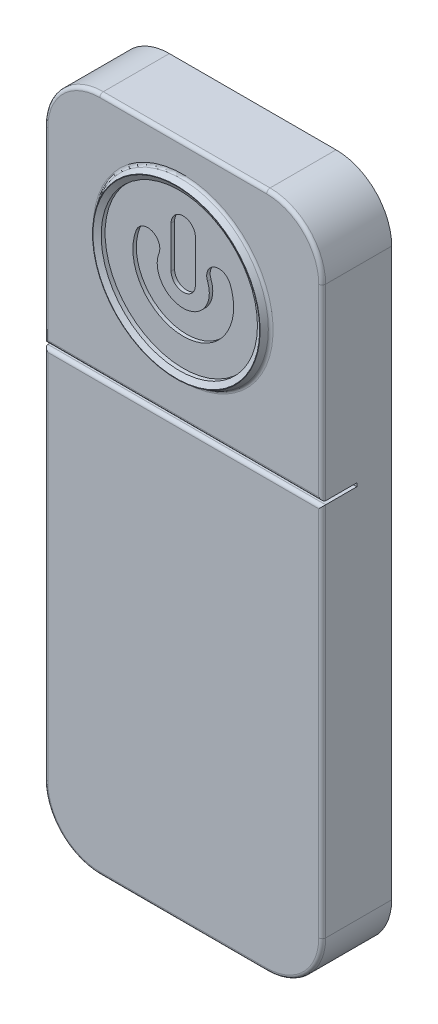
ISO-10303-21;
HEADER;
FILE_DESCRIPTION(('STEP AP214'),'2;1');
FILE_NAME('part.step','',(''),(''),'','','');
FILE_SCHEMA(('AUTOMOTIVE_DESIGN { 1 0 10303 214 1 1 1 1 }'));
ENDSEC;
DATA;
#1=APPLICATION_CONTEXT('core data for automotive mechanical design processes');
#2=APPLICATION_PROTOCOL_DEFINITION('international standard','automotive_design',2000,#1);
#3=PRODUCT_CONTEXT('',#1,'mechanical');
#4=PRODUCT('Part','Part','',(#3));
#5=PRODUCT_RELATED_PRODUCT_CATEGORY('part','',(#4));
#6=PRODUCT_DEFINITION_FORMATION('','',#4);
#7=PRODUCT_DEFINITION_CONTEXT('part definition',#1,'design');
#8=PRODUCT_DEFINITION('design','',#6,#7);
#9=PRODUCT_DEFINITION_SHAPE('','',#8);
#10=(LENGTH_UNIT() NAMED_UNIT(*) SI_UNIT(.MILLI.,.METRE.));
#11=(NAMED_UNIT(*) PLANE_ANGLE_UNIT() SI_UNIT($,.RADIAN.));
#12=(NAMED_UNIT(*) SI_UNIT($,.STERADIAN.) SOLID_ANGLE_UNIT());
#13=UNCERTAINTY_MEASURE_WITH_UNIT(LENGTH_MEASURE(1.E-05),#10,'distance_accuracy_value','');
#14=(GEOMETRIC_REPRESENTATION_CONTEXT(3) GLOBAL_UNCERTAINTY_ASSIGNED_CONTEXT((#13)) GLOBAL_UNIT_ASSIGNED_CONTEXT((#10,
#11,#12)) REPRESENTATION_CONTEXT('',''));
#15=CARTESIAN_POINT('',(0.,0.,0.));
#16=DIRECTION('',(0.,0.,1.));
#17=DIRECTION('',(1.,0.,0.));
#18=AXIS2_PLACEMENT_3D('',#15,#16,#17);
#19=CARTESIAN_POINT('',(0.,0.,2.));
#20=DIRECTION('',(0.,0.,-1.));
#21=DIRECTION('',(-1.,0.,0.));
#22=AXIS2_PLACEMENT_3D('',#19,#20,#21);
#23=PLANE('',#22);
#24=DIRECTION('',(-1.,0.,0.));
#25=VECTOR('',#24,1.);
#26=CARTESIAN_POINT('',(0.,19.4,2.));
#27=LINE('',#26,#25);
#28=CARTESIAN_POINT('',(6.4,19.4,2.));
#29=VERTEX_POINT('',#28);
#30=CARTESIAN_POINT('',(1.6,19.4,2.));
#31=VERTEX_POINT('',#30);
#32=EDGE_CURVE('E372',#29,#31,#27,.T.);
#33=ORIENTED_EDGE('',*,*,#32,.T.);
#34=CARTESIAN_POINT('',(1.6,17.9,2.));
#35=DIRECTION('',(0.,0.,-1.));
#36=DIRECTION('',(-1.,0.,0.));
#37=AXIS2_PLACEMENT_3D('',#34,#35,#36);
#38=CIRCLE('',#37,1.5);
#39=CARTESIAN_POINT('',(0.1,17.9,2.));
#40=VERTEX_POINT('',#39);
#41=EDGE_CURVE('E374',#31,#40,#38,.F.);
#42=ORIENTED_EDGE('',*,*,#41,.T.);
#43=DIRECTION('',(0.,-1.,0.));
#44=VECTOR('',#43,1.);
#45=CARTESIAN_POINT('',(0.1,0.,2.));
#46=LINE('',#45,#44);
#47=CARTESIAN_POINT('',(0.1,12.6,2.));
#48=VERTEX_POINT('',#47);
#49=EDGE_CURVE('E364',#40,#48,#46,.T.);
#50=ORIENTED_EDGE('',*,*,#49,.T.);
#51=DIRECTION('',(-1.,0.,0.));
#52=VECTOR('',#51,1.);
#53=CARTESIAN_POINT('',(0.,12.6,2.));
#54=LINE('',#53,#52);
#55=CARTESIAN_POINT('',(7.9,12.6,2.));
#56=VERTEX_POINT('',#55);
#57=EDGE_CURVE('E366',#48,#56,#54,.F.);
#58=ORIENTED_EDGE('',*,*,#57,.T.);
#59=DIRECTION('',(0.,1.,0.));
#60=VECTOR('',#59,1.);
#61=CARTESIAN_POINT('',(7.9,0.,2.));
#62=LINE('',#61,#60);
#63=CARTESIAN_POINT('',(7.9,17.9,2.));
#64=VERTEX_POINT('',#63);
#65=EDGE_CURVE('E368',#56,#64,#62,.T.);
#66=ORIENTED_EDGE('',*,*,#65,.T.);
#67=CARTESIAN_POINT('',(6.4,17.9,2.));
#68=DIRECTION('',(0.,0.,-1.));
#69=DIRECTION('',(-1.,0.,0.));
#70=AXIS2_PLACEMENT_3D('',#67,#68,#69);
#71=CIRCLE('',#70,1.5);
#72=EDGE_CURVE('E370',#64,#29,#71,.F.);
#73=ORIENTED_EDGE('',*,*,#72,.T.);
#74=EDGE_LOOP('',(#33,#42,#50,#58,#66,#73));
#75=FACE_BOUND('',#74,.T.);
#76=CARTESIAN_POINT('',(4.,16.1,2.));
#77=DIRECTION('',(0.,0.,-1.));
#78=DIRECTION('',(-1.,0.,0.));
#79=AXIS2_PLACEMENT_3D('',#76,#77,#78);
#80=CIRCLE('',#79,2.58660254037844);
#81=CARTESIAN_POINT('',(1.41339745962156,16.1,2.));
#82=VERTEX_POINT('',#81);
#83=EDGE_CURVE('E361',#82,#82,#80,.T.);
#84=ORIENTED_EDGE('',*,*,#83,.T.);
#85=EDGE_LOOP('',(#84));
#86=FACE_BOUND('',#85,.T.);
#87=ADVANCED_FACE('F35',(#75,#86),#23,.F.);
#88=DIRECTION('',(1.,0.,0.));
#89=VECTOR('',#88,1.);
#90=CARTESIAN_POINT('',(0.,0.1,2.));
#91=LINE('',#90,#89);
#92=CARTESIAN_POINT('',(1.6,0.1,2.));
#93=VERTEX_POINT('',#92);
#94=CARTESIAN_POINT('',(6.4,0.1,2.));
#95=VERTEX_POINT('',#94);
#96=EDGE_CURVE('E401',#93,#95,#91,.T.);
#97=ORIENTED_EDGE('',*,*,#96,.T.);
#98=CARTESIAN_POINT('',(6.4,1.6,2.));
#99=DIRECTION('',(0.,0.,-1.));
#100=DIRECTION('',(-1.,0.,0.));
#101=AXIS2_PLACEMENT_3D('',#98,#99,#100);
#102=CIRCLE('',#101,1.5);
#103=CARTESIAN_POINT('',(7.9,1.6,2.));
#104=VERTEX_POINT('',#103);
#105=EDGE_CURVE('E403',#95,#104,#102,.F.);
#106=ORIENTED_EDGE('',*,*,#105,.T.);
#107=DIRECTION('',(0.,1.,0.));
#108=VECTOR('',#107,1.);
#109=CARTESIAN_POINT('',(7.9,0.,2.));
#110=LINE('',#109,#108);
#111=CARTESIAN_POINT('',(7.9,12.3,2.));
#112=VERTEX_POINT('',#111);
#113=EDGE_CURVE('E393',#104,#112,#110,.T.);
#114=ORIENTED_EDGE('',*,*,#113,.T.);
#115=DIRECTION('',(1.,0.,0.));
#116=VECTOR('',#115,1.);
#117=CARTESIAN_POINT('',(0.,12.3,2.));
#118=LINE('',#117,#116);
#119=CARTESIAN_POINT('',(0.1,12.3,2.));
#120=VERTEX_POINT('',#119);
#121=EDGE_CURVE('E395',#112,#120,#118,.F.);
#122=ORIENTED_EDGE('',*,*,#121,.T.);
#123=DIRECTION('',(0.,-1.,0.));
#124=VECTOR('',#123,1.);
#125=CARTESIAN_POINT('',(0.1,0.,2.));
#126=LINE('',#125,#124);
#127=CARTESIAN_POINT('',(0.1,1.6,2.));
#128=VERTEX_POINT('',#127);
#129=EDGE_CURVE('E397',#120,#128,#126,.T.);
#130=ORIENTED_EDGE('',*,*,#129,.T.);
#131=CARTESIAN_POINT('',(1.6,1.6,2.));
#132=DIRECTION('',(0.,0.,-1.));
#133=DIRECTION('',(-1.,0.,0.));
#134=AXIS2_PLACEMENT_3D('',#131,#132,#133);
#135=CIRCLE('',#134,1.5);
#136=EDGE_CURVE('E399',#128,#93,#135,.F.);
#137=ORIENTED_EDGE('',*,*,#136,.T.);
#138=EDGE_LOOP('',(#97,#106,#114,#122,#130,#137));
#139=FACE_BOUND('',#138,.T.);
#140=ADVANCED_FACE('F507',(#139),#23,.F.);
#141=CARTESIAN_POINT('',(0.,0.,2.));
#142=DIRECTION('',(1.,0.,0.));
#143=DIRECTION('',(0.,0.,-1.));
#144=AXIS2_PLACEMENT_3D('',#141,#142,#143);
#145=PLANE('',#144);
#146=DIRECTION('',(0.,0.,1.));
#147=VECTOR('',#146,1.);
#148=CARTESIAN_POINT('',(0.,12.5,1.));
#149=LINE('',#148,#147);
#150=CARTESIAN_POINT('',(0.,12.5,1.));
#151=VERTEX_POINT('',#150);
#152=CARTESIAN_POINT('',(0.,12.5,1.9));
#153=VERTEX_POINT('',#152);
#154=EDGE_CURVE('E247',#151,#153,#149,.T.);
#155=ORIENTED_EDGE('',*,*,#154,.T.);
#156=DIRECTION('',(0.,-1.,0.));
#157=VECTOR('',#156,1.);
#158=CARTESIAN_POINT('',(0.,0.,1.9));
#159=LINE('',#158,#157);
#160=CARTESIAN_POINT('',(0.,17.9,1.9));
#161=VERTEX_POINT('',#160);
#162=EDGE_CURVE('E391',#153,#161,#159,.F.);
#163=ORIENTED_EDGE('',*,*,#162,.T.);
#164=DIRECTION('',(0.,0.,-1.));
#165=VECTOR('',#164,1.);
#166=CARTESIAN_POINT('',(0.,17.9,2.));
#167=LINE('',#166,#165);
#168=CARTESIAN_POINT('',(0.,17.9,0.));
#169=VERTEX_POINT('',#168);
#170=EDGE_CURVE('E340',#161,#169,#167,.T.);
#171=ORIENTED_EDGE('',*,*,#170,.T.);
#172=DIRECTION('',(0.,-1.,0.));
#173=VECTOR('',#172,1.);
#174=CARTESIAN_POINT('',(0.,0.,0.));
#175=LINE('',#174,#173);
#176=CARTESIAN_POINT('',(0.,1.6,0.));
#177=VERTEX_POINT('',#176);
#178=EDGE_CURVE('E305',#169,#177,#175,.T.);
#179=ORIENTED_EDGE('',*,*,#178,.T.);
#180=DIRECTION('',(0.,0.,-1.));
#181=VECTOR('',#180,1.);
#182=CARTESIAN_POINT('',(0.,1.6,2.));
#183=LINE('',#182,#181);
#184=CARTESIAN_POINT('',(0.,1.6,1.9));
#185=VERTEX_POINT('',#184);
#186=EDGE_CURVE('E342',#177,#185,#183,.F.);
#187=ORIENTED_EDGE('',*,*,#186,.T.);
#188=DIRECTION('',(0.,-1.,0.));
#189=VECTOR('',#188,1.);
#190=CARTESIAN_POINT('',(0.,0.,1.9));
#191=LINE('',#190,#189);
#192=CARTESIAN_POINT('',(0.,12.4,1.9));
#193=VERTEX_POINT('',#192);
#194=EDGE_CURVE('E236',#185,#193,#191,.F.);
#195=ORIENTED_EDGE('',*,*,#194,.T.);
#196=DIRECTION('',(0.,0.,1.));
#197=VECTOR('',#196,1.);
#198=CARTESIAN_POINT('',(0.,12.4,1.));
#199=LINE('',#198,#197);
#200=CARTESIAN_POINT('',(0.,12.4,1.));
#201=VERTEX_POINT('',#200);
#202=EDGE_CURVE('E215',#201,#193,#199,.T.);
#203=ORIENTED_EDGE('',*,*,#202,.F.);
#204=DIRECTION('',(0.,-1.,0.));
#205=VECTOR('',#204,1.);
#206=CARTESIAN_POINT('',(0.,12.5,1.));
#207=LINE('',#206,#205);
#208=EDGE_CURVE('E222',#151,#201,#207,.T.);
#209=ORIENTED_EDGE('',*,*,#208,.F.);
#210=EDGE_LOOP('',(#155,#163,#171,#179,#187,#195,#203,#209));
#211=FACE_BOUND('',#210,.T.);
#212=ADVANCED_FACE('F233',(#211),#145,.F.);
#213=CARTESIAN_POINT('',(0.,0.,2.));
#214=DIRECTION('',(0.,1.,0.));
#215=DIRECTION('',(0.,0.,1.));
#216=AXIS2_PLACEMENT_3D('',#213,#214,#215);
#217=PLANE('',#216);
#218=DIRECTION('',(0.,0.,-1.));
#219=VECTOR('',#218,1.);
#220=CARTESIAN_POINT('',(6.4,0.,2.));
#221=LINE('',#220,#219);
#222=CARTESIAN_POINT('',(6.4,0.,0.));
#223=VERTEX_POINT('',#222);
#224=CARTESIAN_POINT('',(6.4,0.,1.9));
#225=VERTEX_POINT('',#224);
#226=EDGE_CURVE('E338',#223,#225,#221,.F.);
#227=ORIENTED_EDGE('',*,*,#226,.T.);
#228=DIRECTION('',(1.,0.,0.));
#229=VECTOR('',#228,1.);
#230=CARTESIAN_POINT('',(0.,0.,1.9));
#231=LINE('',#230,#229);
#232=CARTESIAN_POINT('',(1.6,0.,1.9));
#233=VERTEX_POINT('',#232);
#234=EDGE_CURVE('E52',#225,#233,#231,.F.);
#235=ORIENTED_EDGE('',*,*,#234,.T.);
#236=DIRECTION('',(0.,0.,-1.));
#237=VECTOR('',#236,1.);
#238=CARTESIAN_POINT('',(1.6,0.,2.));
#239=LINE('',#238,#237);
#240=CARTESIAN_POINT('',(1.6,0.,0.));
#241=VERTEX_POINT('',#240);
#242=EDGE_CURVE('E336',#233,#241,#239,.T.);
#243=ORIENTED_EDGE('',*,*,#242,.T.);
#244=DIRECTION('',(1.,0.,0.));
#245=VECTOR('',#244,1.);
#246=CARTESIAN_POINT('',(0.,0.,0.));
#247=LINE('',#246,#245);
#248=EDGE_CURVE('E314',#241,#223,#247,.T.);
#249=ORIENTED_EDGE('',*,*,#248,.T.);
#250=EDGE_LOOP('',(#227,#235,#243,#249));
#251=FACE_BOUND('',#250,.T.);
#252=ADVANCED_FACE('F591',(#251),#217,.F.);
#253=CARTESIAN_POINT('',(8.,0.,2.));
#254=DIRECTION('',(-1.,0.,0.));
#255=DIRECTION('',(0.,0.,1.));
#256=AXIS2_PLACEMENT_3D('',#253,#254,#255);
#257=PLANE('',#256);
#258=DIRECTION('',(0.,0.,-1.));
#259=VECTOR('',#258,1.);
#260=CARTESIAN_POINT('',(8.,17.9,2.));
#261=LINE('',#260,#259);
#262=CARTESIAN_POINT('',(8.,17.9,0.));
#263=VERTEX_POINT('',#262);
#264=CARTESIAN_POINT('',(8.,17.9,1.9));
#265=VERTEX_POINT('',#264);
#266=EDGE_CURVE('E323',#263,#265,#261,.F.);
#267=ORIENTED_EDGE('',*,*,#266,.T.);
#268=DIRECTION('',(0.,1.,0.));
#269=VECTOR('',#268,1.);
#270=CARTESIAN_POINT('',(8.,0.,1.9));
#271=LINE('',#270,#269);
#272=CARTESIAN_POINT('',(8.,12.5,1.9));
#273=VERTEX_POINT('',#272);
#274=EDGE_CURVE('E386',#265,#273,#271,.F.);
#275=ORIENTED_EDGE('',*,*,#274,.T.);
#276=DIRECTION('',(0.,0.,1.));
#277=VECTOR('',#276,1.);
#278=CARTESIAN_POINT('',(8.,12.5,1.));
#279=LINE('',#278,#277);
#280=CARTESIAN_POINT('',(8.,12.5,1.));
#281=VERTEX_POINT('',#280);
#282=EDGE_CURVE('E238',#281,#273,#279,.T.);
#283=ORIENTED_EDGE('',*,*,#282,.F.);
#284=DIRECTION('',(0.,1.,0.));
#285=VECTOR('',#284,1.);
#286=CARTESIAN_POINT('',(8.,12.5,1.));
#287=LINE('',#286,#285);
#288=CARTESIAN_POINT('',(8.,12.4,1.));
#289=VERTEX_POINT('',#288);
#290=EDGE_CURVE('E221',#289,#281,#287,.T.);
#291=ORIENTED_EDGE('',*,*,#290,.F.);
#292=DIRECTION('',(0.,0.,1.));
#293=VECTOR('',#292,1.);
#294=CARTESIAN_POINT('',(8.,12.4,1.));
#295=LINE('',#294,#293);
#296=CARTESIAN_POINT('',(8.,12.4,1.9));
#297=VERTEX_POINT('',#296);
#298=EDGE_CURVE('E218',#289,#297,#295,.T.);
#299=ORIENTED_EDGE('',*,*,#298,.T.);
#300=DIRECTION('',(0.,1.,0.));
#301=VECTOR('',#300,1.);
#302=CARTESIAN_POINT('',(8.,0.,1.9));
#303=LINE('',#302,#301);
#304=CARTESIAN_POINT('',(8.,1.6,1.9));
#305=VERTEX_POINT('',#304);
#306=EDGE_CURVE('E384',#297,#305,#303,.F.);
#307=ORIENTED_EDGE('',*,*,#306,.T.);
#308=DIRECTION('',(0.,0.,-1.));
#309=VECTOR('',#308,1.);
#310=CARTESIAN_POINT('',(8.,1.6,2.));
#311=LINE('',#310,#309);
#312=CARTESIAN_POINT('',(8.,1.6,0.));
#313=VERTEX_POINT('',#312);
#314=EDGE_CURVE('E326',#305,#313,#311,.T.);
#315=ORIENTED_EDGE('',*,*,#314,.T.);
#316=DIRECTION('',(0.,1.,0.));
#317=VECTOR('',#316,1.);
#318=CARTESIAN_POINT('',(8.,0.,0.));
#319=LINE('',#318,#317);
#320=EDGE_CURVE('E317',#313,#263,#319,.T.);
#321=ORIENTED_EDGE('',*,*,#320,.T.);
#322=EDGE_LOOP('',(#267,#275,#283,#291,#299,#307,#315,#321));
#323=FACE_BOUND('',#322,.T.);
#324=ADVANCED_FACE('F452',(#323),#257,.F.);
#325=CARTESIAN_POINT('',(0.,19.5,2.));
#326=DIRECTION('',(0.,-1.,0.));
#327=DIRECTION('',(1.,0.,0.));
#328=AXIS2_PLACEMENT_3D('',#325,#326,#327);
#329=PLANE('',#328);
#330=DIRECTION('',(0.,0.,-1.));
#331=VECTOR('',#330,1.);
#332=CARTESIAN_POINT('',(1.6,19.5,2.));
#333=LINE('',#332,#331);
#334=CARTESIAN_POINT('',(1.6,19.5,0.));
#335=VERTEX_POINT('',#334);
#336=CARTESIAN_POINT('',(1.6,19.5,1.9));
#337=VERTEX_POINT('',#336);
#338=EDGE_CURVE('E344',#335,#337,#333,.F.);
#339=ORIENTED_EDGE('',*,*,#338,.T.);
#340=DIRECTION('',(-1.,0.,0.));
#341=VECTOR('',#340,1.);
#342=CARTESIAN_POINT('',(0.,19.5,1.9));
#343=LINE('',#342,#341);
#344=CARTESIAN_POINT('',(6.4,19.5,1.9));
#345=VERTEX_POINT('',#344);
#346=EDGE_CURVE('E380',#337,#345,#343,.F.);
#347=ORIENTED_EDGE('',*,*,#346,.T.);
#348=DIRECTION('',(0.,0.,-1.));
#349=VECTOR('',#348,1.);
#350=CARTESIAN_POINT('',(6.4,19.5,2.));
#351=LINE('',#350,#349);
#352=CARTESIAN_POINT('',(6.4,19.5,0.));
#353=VERTEX_POINT('',#352);
#354=EDGE_CURVE('E347',#345,#353,#351,.T.);
#355=ORIENTED_EDGE('',*,*,#354,.T.);
#356=DIRECTION('',(-1.,0.,0.));
#357=VECTOR('',#356,1.);
#358=CARTESIAN_POINT('',(0.,19.5,0.));
#359=LINE('',#358,#357);
#360=EDGE_CURVE('E320',#353,#335,#359,.T.);
#361=ORIENTED_EDGE('',*,*,#360,.T.);
#362=EDGE_LOOP('',(#339,#347,#355,#361));
#363=FACE_BOUND('',#362,.T.);
#364=ADVANCED_FACE('F494',(#363),#329,.F.);
#365=CARTESIAN_POINT('',(0.,0.,0.));
#366=DIRECTION('',(0.,0.,-1.));
#367=DIRECTION('',(-1.,0.,0.));
#368=AXIS2_PLACEMENT_3D('',#365,#366,#367);
#369=PLANE('',#368);
#370=ORIENTED_EDGE('',*,*,#320,.F.);
#371=CARTESIAN_POINT('',(6.4,1.6,0.));
#372=DIRECTION('',(0.,0.,-1.));
#373=DIRECTION('',(-1.,0.,0.));
#374=AXIS2_PLACEMENT_3D('',#371,#372,#373);
#375=CIRCLE('',#374,1.6);
#376=EDGE_CURVE('E334',#313,#223,#375,.T.);
#377=ORIENTED_EDGE('',*,*,#376,.T.);
#378=ORIENTED_EDGE('',*,*,#248,.F.);
#379=CARTESIAN_POINT('',(1.6,1.6,0.));
#380=DIRECTION('',(0.,0.,-1.));
#381=DIRECTION('',(-1.,0.,0.));
#382=AXIS2_PLACEMENT_3D('',#379,#380,#381);
#383=CIRCLE('',#382,1.6);
#384=EDGE_CURVE('E332',#241,#177,#383,.T.);
#385=ORIENTED_EDGE('',*,*,#384,.T.);
#386=ORIENTED_EDGE('',*,*,#178,.F.);
#387=CARTESIAN_POINT('',(1.6,17.9,0.));
#388=DIRECTION('',(0.,0.,-1.));
#389=DIRECTION('',(-1.,0.,0.));
#390=AXIS2_PLACEMENT_3D('',#387,#388,#389);
#391=CIRCLE('',#390,1.6);
#392=EDGE_CURVE('E328',#169,#335,#391,.T.);
#393=ORIENTED_EDGE('',*,*,#392,.T.);
#394=ORIENTED_EDGE('',*,*,#360,.F.);
#395=CARTESIAN_POINT('',(6.4,17.9,0.));
#396=DIRECTION('',(0.,0.,-1.));
#397=DIRECTION('',(-1.,0.,0.));
#398=AXIS2_PLACEMENT_3D('',#395,#396,#397);
#399=CIRCLE('',#398,1.6);
#400=EDGE_CURVE('E330',#353,#263,#399,.T.);
#401=ORIENTED_EDGE('',*,*,#400,.T.);
#402=EDGE_LOOP('',(#370,#377,#378,#385,#386,#393,#394,#401));
#403=FACE_BOUND('',#402,.T.);
#404=ADVANCED_FACE('F582',(#403),#369,.T.);
#405=CARTESIAN_POINT('',(6.4,1.6,2.));
#406=DIRECTION('',(0.,0.,-1.));
#407=DIRECTION('',(-1.,0.,0.));
#408=AXIS2_PLACEMENT_3D('',#405,#406,#407);
#409=CYLINDRICAL_SURFACE('',#408,1.6);
#410=ORIENTED_EDGE('',*,*,#314,.F.);
#411=CARTESIAN_POINT('',(6.4,1.6,1.9));
#412=DIRECTION('',(0.,0.,-1.));
#413=DIRECTION('',(-1.,0.,0.));
#414=AXIS2_PLACEMENT_3D('',#411,#412,#413);
#415=CIRCLE('',#414,1.6);
#416=EDGE_CURVE('E406',#305,#225,#415,.T.);
#417=ORIENTED_EDGE('',*,*,#416,.T.);
#418=ORIENTED_EDGE('',*,*,#226,.F.);
#419=ORIENTED_EDGE('',*,*,#376,.F.);
#420=EDGE_LOOP('',(#410,#417,#418,#419));
#421=FACE_BOUND('',#420,.T.);
#422=ADVANCED_FACE('F585',(#421),#409,.T.);
#423=CARTESIAN_POINT('',(1.6,1.6,2.));
#424=DIRECTION('',(0.,0.,-1.));
#425=DIRECTION('',(-1.,0.,0.));
#426=AXIS2_PLACEMENT_3D('',#423,#424,#425);
#427=CYLINDRICAL_SURFACE('',#426,1.6);
#428=ORIENTED_EDGE('',*,*,#242,.F.);
#429=CARTESIAN_POINT('',(1.6,1.6,1.9));
#430=DIRECTION('',(0.,0.,-1.));
#431=DIRECTION('',(-1.,0.,0.));
#432=AXIS2_PLACEMENT_3D('',#429,#430,#431);
#433=CIRCLE('',#432,1.6);
#434=EDGE_CURVE('E44',#233,#185,#433,.T.);
#435=ORIENTED_EDGE('',*,*,#434,.T.);
#436=ORIENTED_EDGE('',*,*,#186,.F.);
#437=ORIENTED_EDGE('',*,*,#384,.F.);
#438=EDGE_LOOP('',(#428,#435,#436,#437));
#439=FACE_BOUND('',#438,.T.);
#440=ADVANCED_FACE('F598',(#439),#427,.T.);
#441=CARTESIAN_POINT('',(6.4,17.9,2.));
#442=DIRECTION('',(0.,0.,-1.));
#443=DIRECTION('',(-1.,0.,0.));
#444=AXIS2_PLACEMENT_3D('',#441,#442,#443);
#445=CYLINDRICAL_SURFACE('',#444,1.6);
#446=ORIENTED_EDGE('',*,*,#354,.F.);
#447=CARTESIAN_POINT('',(6.4,17.9,1.9));
#448=DIRECTION('',(0.,0.,-1.));
#449=DIRECTION('',(-1.,0.,0.));
#450=AXIS2_PLACEMENT_3D('',#447,#448,#449);
#451=CIRCLE('',#450,1.6);
#452=EDGE_CURVE('E382',#345,#265,#451,.T.);
#453=ORIENTED_EDGE('',*,*,#452,.T.);
#454=ORIENTED_EDGE('',*,*,#266,.F.);
#455=ORIENTED_EDGE('',*,*,#400,.F.);
#456=EDGE_LOOP('',(#446,#453,#454,#455));
#457=FACE_BOUND('',#456,.T.);
#458=ADVANCED_FACE('F498',(#457),#445,.T.);
#459=CARTESIAN_POINT('',(1.6,17.9,2.));
#460=DIRECTION('',(0.,0.,-1.));
#461=DIRECTION('',(-1.,0.,0.));
#462=AXIS2_PLACEMENT_3D('',#459,#460,#461);
#463=CYLINDRICAL_SURFACE('',#462,1.6);
#464=ORIENTED_EDGE('',*,*,#170,.F.);
#465=CARTESIAN_POINT('',(1.6,17.9,1.9));
#466=DIRECTION('',(0.,0.,-1.));
#467=DIRECTION('',(-1.,0.,0.));
#468=AXIS2_PLACEMENT_3D('',#465,#466,#467);
#469=CIRCLE('',#468,1.6);
#470=EDGE_CURVE('E377',#161,#337,#469,.T.);
#471=ORIENTED_EDGE('',*,*,#470,.T.);
#472=ORIENTED_EDGE('',*,*,#338,.F.);
#473=ORIENTED_EDGE('',*,*,#392,.F.);
#474=EDGE_LOOP('',(#464,#471,#472,#473));
#475=FACE_BOUND('',#474,.T.);
#476=ADVANCED_FACE('F480',(#475),#463,.T.);
#477=CARTESIAN_POINT('',(4.,16.1,2.2));
#478=DIRECTION('',(0.,0.,1.));
#479=DIRECTION('',(1.,0.,0.));
#480=AXIS2_PLACEMENT_3D('',#477,#478,#479);
#481=PLANE('',#480);
#482=CARTESIAN_POINT('',(4.,16.1,2.2));
#483=DIRECTION('',(0.,0.,1.));
#484=DIRECTION('',(1.,0.,0.));
#485=AXIS2_PLACEMENT_3D('',#482,#483,#484);
#486=CIRCLE('',#485,2.4);
#487=CARTESIAN_POINT('',(6.4,16.1,2.2));
#488=VERTEX_POINT('',#487);
#489=EDGE_CURVE('E355',#488,#488,#486,.F.);
#490=ORIENTED_EDGE('',*,*,#489,.T.);
#491=EDGE_LOOP('',(#490));
#492=FACE_BOUND('',#491,.T.);
#493=CARTESIAN_POINT('',(4.,16.1,2.2));
#494=DIRECTION('',(0.,0.,1.));
#495=DIRECTION('',(1.,0.,0.));
#496=AXIS2_PLACEMENT_3D('',#493,#494,#495);
#497=CIRCLE('',#496,2.41339745962155);
#498=CARTESIAN_POINT('',(6.41339745962155,16.1,2.2));
#499=VERTEX_POINT('',#498);
#500=EDGE_CURVE('E352',#499,#499,#497,.T.);
#501=ORIENTED_EDGE('',*,*,#500,.T.);
#502=EDGE_LOOP('',(#501));
#503=FACE_BOUND('',#502,.T.);
#504=ADVANCED_FACE('F525',(#492,#503),#481,.T.);
#505=CARTESIAN_POINT('',(4.,16.1,2.2));
#506=DIRECTION('',(0.,0.,-1.));
#507=DIRECTION('',(-1.,0.,0.));
#508=AXIS2_PLACEMENT_3D('',#505,#506,#507);
#509=CYLINDRICAL_SURFACE('',#508,2.25);
#510=CARTESIAN_POINT('',(4.,16.1,2.11339745962156));
#511=DIRECTION('',(0.,0.,1.));
#512=DIRECTION('',(1.,0.,0.));
#513=AXIS2_PLACEMENT_3D('',#510,#511,#512);
#514=CIRCLE('',#513,2.25);
#515=CARTESIAN_POINT('',(6.25,16.1,2.11339745962156));
#516=VERTEX_POINT('',#515);
#517=EDGE_CURVE('E349',#516,#516,#514,.T.);
#518=ORIENTED_EDGE('',*,*,#517,.T.);
#519=EDGE_LOOP('',(#518));
#520=FACE_BOUND('',#519,.T.);
#521=CARTESIAN_POINT('',(4.,16.1,2.));
#522=DIRECTION('',(0.,0.,1.));
#523=DIRECTION('',(1.,0.,0.));
#524=AXIS2_PLACEMENT_3D('',#521,#522,#523);
#525=CIRCLE('',#524,2.25);
#526=CARTESIAN_POINT('',(6.25,16.1,2.));
#527=VERTEX_POINT('',#526);
#528=EDGE_CURVE('E243',#527,#527,#525,.T.);
#529=ORIENTED_EDGE('',*,*,#528,.F.);
#530=EDGE_LOOP('',(#529));
#531=FACE_BOUND('',#530,.T.);
#532=ADVANCED_FACE('F527',(#520,#531),#509,.F.);
#533=CARTESIAN_POINT('',(4.,17.3,1.9));
#534=DIRECTION('',(0.,0.,1.));
#535=DIRECTION('',(1.,0.,0.));
#536=AXIS2_PLACEMENT_3D('',#533,#534,#535);
#537=PLANE('',#536);
#538=CARTESIAN_POINT('',(4.,17.3,1.9));
#539=DIRECTION('',(0.,0.,1.));
#540=DIRECTION('',(1.,0.,0.));
#541=AXIS2_PLACEMENT_3D('',#538,#539,#540);
#542=CIRCLE('',#541,0.35);
#543=CARTESIAN_POINT('',(4.35,17.3,1.9));
#544=VERTEX_POINT('',#543);
#545=CARTESIAN_POINT('',(3.65,17.3,1.9));
#546=VERTEX_POINT('',#545);
#547=EDGE_CURVE('E280',#544,#546,#542,.T.);
#548=ORIENTED_EDGE('',*,*,#547,.T.);
#549=DIRECTION('',(0.,-1.,0.));
#550=VECTOR('',#549,1.);
#551=CARTESIAN_POINT('',(3.65,17.3,1.9));
#552=LINE('',#551,#550);
#553=CARTESIAN_POINT('',(3.65,16.1,1.9));
#554=VERTEX_POINT('',#553);
#555=EDGE_CURVE('E283',#546,#554,#552,.T.);
#556=ORIENTED_EDGE('',*,*,#555,.T.);
#557=CARTESIAN_POINT('',(4.,16.1,1.9));
#558=DIRECTION('',(0.,0.,1.));
#559=DIRECTION('',(1.,0.,0.));
#560=AXIS2_PLACEMENT_3D('',#557,#558,#559);
#561=CIRCLE('',#560,0.349999999999999);
#562=CARTESIAN_POINT('',(4.35,16.1,1.9));
#563=VERTEX_POINT('',#562);
#564=EDGE_CURVE('E287',#554,#563,#561,.T.);
#565=ORIENTED_EDGE('',*,*,#564,.T.);
#566=DIRECTION('',(0.,1.,0.));
#567=VECTOR('',#566,1.);
#568=CARTESIAN_POINT('',(4.35,17.3,1.9));
#569=LINE('',#568,#567);
#570=EDGE_CURVE('E290',#563,#544,#569,.T.);
#571=ORIENTED_EDGE('',*,*,#570,.T.);
#572=EDGE_LOOP('',(#548,#556,#565,#571));
#573=FACE_BOUND('',#572,.T.);
#574=ADVANCED_FACE('F534',(#573),#537,.T.);
#575=CARTESIAN_POINT('',(3.48765246170202,16.3,1.9));
#576=DIRECTION('',(0.,0.,1.));
#577=DIRECTION('',(1.,0.,0.));
#578=AXIS2_PLACEMENT_3D('',#575,#576,#577);
#579=PLANE('',#578);
#580=CARTESIAN_POINT('',(2.97530492340404,16.5,1.9));
#581=DIRECTION('',(0.,0.,1.));
#582=DIRECTION('',(1.,0.,0.));
#583=AXIS2_PLACEMENT_3D('',#580,#581,#582);
#584=CIRCLE('',#583,0.35);
#585=CARTESIAN_POINT('',(3.3013442659573,16.3727272727273,1.9));
#586=VERTEX_POINT('',#585);
#587=CARTESIAN_POINT('',(2.64926558085078,16.6272727272727,1.9));
#588=VERTEX_POINT('',#587);
#589=EDGE_CURVE('E248',#586,#588,#584,.T.);
#590=ORIENTED_EDGE('',*,*,#589,.T.);
#591=CARTESIAN_POINT('',(4.,16.1,1.9));
#592=DIRECTION('',(0.,0.,1.));
#593=DIRECTION('',(1.,0.,0.));
#594=AXIS2_PLACEMENT_3D('',#591,#592,#593);
#595=CIRCLE('',#594,1.45);
#596=CARTESIAN_POINT('',(5.35073441914922,16.6272727272727,1.9));
#597=VERTEX_POINT('',#596);
#598=EDGE_CURVE('E251',#588,#597,#595,.T.);
#599=ORIENTED_EDGE('',*,*,#598,.T.);
#600=CARTESIAN_POINT('',(5.02469507659596,16.5,1.9));
#601=DIRECTION('',(0.,0.,1.));
#602=DIRECTION('',(1.,0.,0.));
#603=AXIS2_PLACEMENT_3D('',#600,#601,#602);
#604=CIRCLE('',#603,0.35);
#605=CARTESIAN_POINT('',(4.6986557340427,16.3727272727273,1.9));
#606=VERTEX_POINT('',#605);
#607=EDGE_CURVE('E255',#597,#606,#604,.T.);
#608=ORIENTED_EDGE('',*,*,#607,.T.);
#609=CARTESIAN_POINT('',(4.,16.1,1.9));
#610=DIRECTION('',(0.,0.,-1.));
#611=DIRECTION('',(1.,0.,0.));
#612=AXIS2_PLACEMENT_3D('',#609,#610,#611);
#613=CIRCLE('',#612,0.75);
#614=EDGE_CURVE('E258',#606,#586,#613,.T.);
#615=ORIENTED_EDGE('',*,*,#614,.T.);
#616=EDGE_LOOP('',(#590,#599,#608,#615));
#617=FACE_BOUND('',#616,.T.);
#618=ADVANCED_FACE('F541',(#617),#579,.T.);
#619=CARTESIAN_POINT('',(4.,16.1,1.9));
#620=DIRECTION('',(0.,0.,1.));
#621=DIRECTION('',(1.,0.,0.));
#622=AXIS2_PLACEMENT_3D('',#619,#620,#621);
#623=CYLINDRICAL_SURFACE('',#622,0.349999999999999);
#624=CARTESIAN_POINT('',(4.,16.1,2.));
#625=DIRECTION('',(0.,0.,1.));
#626=DIRECTION('',(1.,0.,0.));
#627=AXIS2_PLACEMENT_3D('',#624,#625,#626);
#628=CIRCLE('',#627,0.349999999999999);
#629=CARTESIAN_POINT('',(3.65,16.1,2.));
#630=VERTEX_POINT('',#629);
#631=CARTESIAN_POINT('',(4.35,16.1,2.));
#632=VERTEX_POINT('',#631);
#633=EDGE_CURVE('E298',#630,#632,#628,.T.);
#634=ORIENTED_EDGE('',*,*,#633,.T.);
#635=DIRECTION('',(0.,0.,1.));
#636=VECTOR('',#635,1.);
#637=CARTESIAN_POINT('',(4.35,16.1,1.9));
#638=LINE('',#637,#636);
#639=EDGE_CURVE('E306',#563,#632,#638,.T.);
#640=ORIENTED_EDGE('',*,*,#639,.F.);
#641=ORIENTED_EDGE('',*,*,#564,.F.);
#642=DIRECTION('',(0.,0.,1.));
#643=VECTOR('',#642,1.);
#644=CARTESIAN_POINT('',(3.65,16.1,1.9));
#645=LINE('',#644,#643);
#646=EDGE_CURVE('E308',#554,#630,#645,.T.);
#647=ORIENTED_EDGE('',*,*,#646,.T.);
#648=EDGE_LOOP('',(#634,#640,#641,#647));
#649=FACE_BOUND('',#648,.T.);
#650=ADVANCED_FACE('F544',(#649),#623,.F.);
#651=CARTESIAN_POINT('',(4.35,17.3,1.9));
#652=DIRECTION('',(1.,0.,0.));
#653=DIRECTION('',(0.,1.,0.));
#654=AXIS2_PLACEMENT_3D('',#651,#652,#653);
#655=PLANE('',#654);
#656=DIRECTION('',(0.,1.,0.));
#657=VECTOR('',#656,1.);
#658=CARTESIAN_POINT('',(4.35,17.3,2.));
#659=LINE('',#658,#657);
#660=CARTESIAN_POINT('',(4.35,17.3,2.));
#661=VERTEX_POINT('',#660);
#662=EDGE_CURVE('E284',#632,#661,#659,.T.);
#663=ORIENTED_EDGE('',*,*,#662,.T.);
#664=DIRECTION('',(0.,0.,1.));
#665=VECTOR('',#664,1.);
#666=CARTESIAN_POINT('',(4.35,17.3,1.9));
#667=LINE('',#666,#665);
#668=EDGE_CURVE('E303',#544,#661,#667,.T.);
#669=ORIENTED_EDGE('',*,*,#668,.F.);
#670=ORIENTED_EDGE('',*,*,#570,.F.);
#671=ORIENTED_EDGE('',*,*,#639,.T.);
#672=EDGE_LOOP('',(#663,#669,#670,#671));
#673=FACE_BOUND('',#672,.T.);
#674=ADVANCED_FACE('F566',(#673),#655,.F.);
#675=CARTESIAN_POINT('',(4.,17.3,1.9));
#676=DIRECTION('',(0.,0.,1.));
#677=DIRECTION('',(1.,0.,0.));
#678=AXIS2_PLACEMENT_3D('',#675,#676,#677);
#679=CYLINDRICAL_SURFACE('',#678,0.35);
#680=CARTESIAN_POINT('',(4.,17.3,2.));
#681=DIRECTION('',(0.,0.,1.));
#682=DIRECTION('',(1.,0.,0.));
#683=AXIS2_PLACEMENT_3D('',#680,#681,#682);
#684=CIRCLE('',#683,0.35);
#685=CARTESIAN_POINT('',(3.65,17.3,2.));
#686=VERTEX_POINT('',#685);
#687=EDGE_CURVE('E273',#661,#686,#684,.T.);
#688=ORIENTED_EDGE('',*,*,#687,.T.);
#689=DIRECTION('',(0.,0.,1.));
#690=VECTOR('',#689,1.);
#691=CARTESIAN_POINT('',(3.65,17.3,1.9));
#692=LINE('',#691,#690);
#693=EDGE_CURVE('E293',#546,#686,#692,.T.);
#694=ORIENTED_EDGE('',*,*,#693,.F.);
#695=ORIENTED_EDGE('',*,*,#547,.F.);
#696=ORIENTED_EDGE('',*,*,#668,.T.);
#697=EDGE_LOOP('',(#688,#694,#695,#696));
#698=FACE_BOUND('',#697,.T.);
#699=ADVANCED_FACE('F569',(#698),#679,.F.);
#700=CARTESIAN_POINT('',(3.65,17.3,1.9));
#701=DIRECTION('',(-1.,0.,0.));
#702=DIRECTION('',(0.,-1.,0.));
#703=AXIS2_PLACEMENT_3D('',#700,#701,#702);
#704=PLANE('',#703);
#705=DIRECTION('',(0.,-1.,0.));
#706=VECTOR('',#705,1.);
#707=CARTESIAN_POINT('',(3.65,17.3,2.));
#708=LINE('',#707,#706);
#709=EDGE_CURVE('E295',#686,#630,#708,.T.);
#710=ORIENTED_EDGE('',*,*,#709,.T.);
#711=ORIENTED_EDGE('',*,*,#646,.F.);
#712=ORIENTED_EDGE('',*,*,#555,.F.);
#713=ORIENTED_EDGE('',*,*,#693,.T.);
#714=EDGE_LOOP('',(#710,#711,#712,#713));
#715=FACE_BOUND('',#714,.T.);
#716=ADVANCED_FACE('F554',(#715),#704,.F.);
#717=CARTESIAN_POINT('',(5.02469507659596,16.5,1.9));
#718=DIRECTION('',(0.,0.,1.));
#719=DIRECTION('',(1.,0.,0.));
#720=AXIS2_PLACEMENT_3D('',#717,#718,#719);
#721=CYLINDRICAL_SURFACE('',#720,0.35);
#722=CARTESIAN_POINT('',(5.02469507659596,16.5,2.));
#723=DIRECTION('',(0.,0.,1.));
#724=DIRECTION('',(1.,0.,0.));
#725=AXIS2_PLACEMENT_3D('',#722,#723,#724);
#726=CIRCLE('',#725,0.35);
#727=CARTESIAN_POINT('',(5.35073441914922,16.6272727272727,2.));
#728=VERTEX_POINT('',#727);
#729=CARTESIAN_POINT('',(4.6986557340427,16.3727272727273,2.));
#730=VERTEX_POINT('',#729);
#731=EDGE_CURVE('E266',#728,#730,#726,.T.);
#732=ORIENTED_EDGE('',*,*,#731,.T.);
#733=DIRECTION('',(0.,0.,1.));
#734=VECTOR('',#733,1.);
#735=CARTESIAN_POINT('',(4.6986557340427,16.3727272727273,1.9));
#736=LINE('',#735,#734);
#737=EDGE_CURVE('E274',#606,#730,#736,.T.);
#738=ORIENTED_EDGE('',*,*,#737,.F.);
#739=ORIENTED_EDGE('',*,*,#607,.F.);
#740=DIRECTION('',(0.,0.,1.));
#741=VECTOR('',#740,1.);
#742=CARTESIAN_POINT('',(5.35073441914922,16.6272727272727,1.9));
#743=LINE('',#742,#741);
#744=EDGE_CURVE('E276',#597,#728,#743,.T.);
#745=ORIENTED_EDGE('',*,*,#744,.T.);
#746=EDGE_LOOP('',(#732,#738,#739,#745));
#747=FACE_BOUND('',#746,.T.);
#748=ADVANCED_FACE('F550',(#747),#721,.F.);
#749=CARTESIAN_POINT('',(4.,16.1,1.9));
#750=DIRECTION('',(0.,0.,1.));
#751=DIRECTION('',(1.,0.,0.));
#752=AXIS2_PLACEMENT_3D('',#749,#750,#751);
#753=CYLINDRICAL_SURFACE('',#752,0.75);
#754=CARTESIAN_POINT('',(4.,16.1,2.));
#755=DIRECTION('',(0.,0.,-1.));
#756=DIRECTION('',(1.,0.,0.));
#757=AXIS2_PLACEMENT_3D('',#754,#755,#756);
#758=CIRCLE('',#757,0.75);
#759=CARTESIAN_POINT('',(3.3013442659573,16.3727272727273,2.));
#760=VERTEX_POINT('',#759);
#761=EDGE_CURVE('E252',#730,#760,#758,.T.);
#762=ORIENTED_EDGE('',*,*,#761,.T.);
#763=DIRECTION('',(0.,0.,1.));
#764=VECTOR('',#763,1.);
#765=CARTESIAN_POINT('',(3.3013442659573,16.3727272727273,1.9));
#766=LINE('',#765,#764);
#767=EDGE_CURVE('E271',#586,#760,#766,.T.);
#768=ORIENTED_EDGE('',*,*,#767,.F.);
#769=ORIENTED_EDGE('',*,*,#614,.F.);
#770=ORIENTED_EDGE('',*,*,#737,.T.);
#771=EDGE_LOOP('',(#762,#768,#769,#770));
#772=FACE_BOUND('',#771,.T.);
#773=ADVANCED_FACE('F546',(#772),#753,.T.);
#774=CARTESIAN_POINT('',(2.97530492340404,16.5,1.9));
#775=DIRECTION('',(0.,0.,1.));
#776=DIRECTION('',(1.,0.,0.));
#777=AXIS2_PLACEMENT_3D('',#774,#775,#776);
#778=CYLINDRICAL_SURFACE('',#777,0.35);
#779=CARTESIAN_POINT('',(2.97530492340404,16.5,2.));
#780=DIRECTION('',(0.,0.,1.));
#781=DIRECTION('',(1.,0.,0.));
#782=AXIS2_PLACEMENT_3D('',#779,#780,#781);
#783=CIRCLE('',#782,0.35);
#784=CARTESIAN_POINT('',(2.64926558085078,16.6272727272727,2.));
#785=VERTEX_POINT('',#784);
#786=EDGE_CURVE('E246',#760,#785,#783,.T.);
#787=ORIENTED_EDGE('',*,*,#786,.T.);
#788=DIRECTION('',(0.,0.,1.));
#789=VECTOR('',#788,1.);
#790=CARTESIAN_POINT('',(2.64926558085078,16.6272727272727,1.9));
#791=LINE('',#790,#789);
#792=EDGE_CURVE('E261',#588,#785,#791,.T.);
#793=ORIENTED_EDGE('',*,*,#792,.F.);
#794=ORIENTED_EDGE('',*,*,#589,.F.);
#795=ORIENTED_EDGE('',*,*,#767,.T.);
#796=EDGE_LOOP('',(#787,#793,#794,#795));
#797=FACE_BOUND('',#796,.T.);
#798=ADVANCED_FACE('F549',(#797),#778,.F.);
#799=CARTESIAN_POINT('',(4.,16.1,1.9));
#800=DIRECTION('',(0.,0.,1.));
#801=DIRECTION('',(1.,0.,0.));
#802=AXIS2_PLACEMENT_3D('',#799,#800,#801);
#803=CYLINDRICAL_SURFACE('',#802,1.45);
#804=CARTESIAN_POINT('',(4.,16.1,2.));
#805=DIRECTION('',(0.,0.,1.));
#806=DIRECTION('',(1.,0.,0.));
#807=AXIS2_PLACEMENT_3D('',#804,#805,#806);
#808=CIRCLE('',#807,1.45);
#809=EDGE_CURVE('E263',#785,#728,#808,.T.);
#810=ORIENTED_EDGE('',*,*,#809,.T.);
#811=ORIENTED_EDGE('',*,*,#744,.F.);
#812=ORIENTED_EDGE('',*,*,#598,.F.);
#813=ORIENTED_EDGE('',*,*,#792,.T.);
#814=EDGE_LOOP('',(#810,#811,#812,#813));
#815=FACE_BOUND('',#814,.T.);
#816=ADVANCED_FACE('F556',(#815),#803,.F.);
#817=ORIENTED_EDGE('',*,*,#528,.T.);
#818=EDGE_LOOP('',(#817));
#819=FACE_BOUND('',#818,.T.);
#820=ORIENTED_EDGE('',*,*,#809,.F.);
#821=ORIENTED_EDGE('',*,*,#786,.F.);
#822=ORIENTED_EDGE('',*,*,#761,.F.);
#823=ORIENTED_EDGE('',*,*,#731,.F.);
#824=EDGE_LOOP('',(#820,#821,#822,#823));
#825=FACE_BOUND('',#824,.T.);
#826=ORIENTED_EDGE('',*,*,#709,.F.);
#827=ORIENTED_EDGE('',*,*,#687,.F.);
#828=ORIENTED_EDGE('',*,*,#662,.F.);
#829=ORIENTED_EDGE('',*,*,#633,.F.);
#830=EDGE_LOOP('',(#826,#827,#828,#829));
#831=FACE_BOUND('',#830,.T.);
#832=ADVANCED_FACE('F509',(#819,#825,#831),#23,.F.);
#833=CARTESIAN_POINT('',(4.,16.1,2.11339745962156));
#834=DIRECTION('',(0.,0.,1.));
#835=DIRECTION('',(1.,0.,0.));
#836=AXIS2_PLACEMENT_3D('',#833,#834,#835);
#837=CONICAL_SURFACE('',#836,2.25,1.0471975511966);
#838=ORIENTED_EDGE('',*,*,#489,.F.);
#839=EDGE_LOOP('',(#838));
#840=FACE_BOUND('',#839,.T.);
#841=ORIENTED_EDGE('',*,*,#517,.F.);
#842=EDGE_LOOP('',(#841));
#843=FACE_BOUND('',#842,.T.);
#844=ADVANCED_FACE('F521',(#840,#843),#837,.F.);
#845=CARTESIAN_POINT('',(4.,16.1,2.2));
#846=DIRECTION('',(0.,0.,-1.));
#847=DIRECTION('',(-1.,0.,0.));
#848=AXIS2_PLACEMENT_3D('',#845,#846,#847);
#849=CONICAL_SURFACE('',#848,2.41339745962155,0.523598775598298);
#850=CARTESIAN_POINT('',(4.,16.1,2.05));
#851=DIRECTION('',(0.,0.,1.));
#852=DIRECTION('',(1.,0.,0.));
#853=AXIS2_PLACEMENT_3D('',#850,#851,#852);
#854=CIRCLE('',#853,2.5);
#855=CARTESIAN_POINT('',(6.5,16.1,2.05));
#856=VERTEX_POINT('',#855);
#857=EDGE_CURVE('E358',#856,#856,#854,.F.);
#858=ORIENTED_EDGE('',*,*,#857,.F.);
#859=EDGE_LOOP('',(#858));
#860=FACE_BOUND('',#859,.T.);
#861=ORIENTED_EDGE('',*,*,#500,.F.);
#862=EDGE_LOOP('',(#861));
#863=FACE_BOUND('',#862,.T.);
#864=ADVANCED_FACE('F518',(#860,#863),#849,.T.);
#865=CARTESIAN_POINT('',(0.,12.5,1.));
#866=DIRECTION('',(0.,1.,0.));
#867=DIRECTION('',(0.,0.,1.));
#868=AXIS2_PLACEMENT_3D('',#865,#866,#867);
#869=PLANE('',#868);
#870=ORIENTED_EDGE('',*,*,#282,.T.);
#871=DIRECTION('',(-1.,0.,0.));
#872=VECTOR('',#871,1.);
#873=CARTESIAN_POINT('',(0.,12.5,1.9));
#874=LINE('',#873,#872);
#875=EDGE_CURVE('E388',#273,#153,#874,.T.);
#876=ORIENTED_EDGE('',*,*,#875,.T.);
#877=ORIENTED_EDGE('',*,*,#154,.F.);
#878=DIRECTION('',(-1.,0.,0.));
#879=VECTOR('',#878,1.);
#880=CARTESIAN_POINT('',(0.,12.5,1.));
#881=LINE('',#880,#879);
#882=EDGE_CURVE('E228',#281,#151,#881,.T.);
#883=ORIENTED_EDGE('',*,*,#882,.F.);
#884=EDGE_LOOP('',(#870,#876,#877,#883));
#885=FACE_BOUND('',#884,.T.);
#886=ADVANCED_FACE('F460',(#885),#869,.F.);
#887=CARTESIAN_POINT('',(0.,12.4,1.));
#888=DIRECTION('',(0.,-1.,0.));
#889=DIRECTION('',(0.,0.,-1.));
#890=AXIS2_PLACEMENT_3D('',#887,#888,#889);
#891=PLANE('',#890);
#892=ORIENTED_EDGE('',*,*,#202,.T.);
#893=DIRECTION('',(1.,0.,0.));
#894=VECTOR('',#893,1.);
#895=CARTESIAN_POINT('',(0.,12.4,1.9));
#896=LINE('',#895,#894);
#897=EDGE_CURVE('E11',#193,#297,#896,.T.);
#898=ORIENTED_EDGE('',*,*,#897,.T.);
#899=ORIENTED_EDGE('',*,*,#298,.F.);
#900=DIRECTION('',(1.,0.,0.));
#901=VECTOR('',#900,1.);
#902=CARTESIAN_POINT('',(0.,12.4,1.));
#903=LINE('',#902,#901);
#904=EDGE_CURVE('E211',#201,#289,#903,.T.);
#905=ORIENTED_EDGE('',*,*,#904,.F.);
#906=EDGE_LOOP('',(#892,#898,#899,#905));
#907=FACE_BOUND('',#906,.T.);
#908=ADVANCED_FACE('F213',(#907),#891,.F.);
#909=CARTESIAN_POINT('',(0.,0.,1.));
#910=DIRECTION('',(0.,0.,1.));
#911=DIRECTION('',(1.,0.,0.));
#912=AXIS2_PLACEMENT_3D('',#909,#910,#911);
#913=PLANE('',#912);
#914=ORIENTED_EDGE('',*,*,#208,.T.);
#915=ORIENTED_EDGE('',*,*,#904,.T.);
#916=ORIENTED_EDGE('',*,*,#290,.T.);
#917=ORIENTED_EDGE('',*,*,#882,.T.);
#918=EDGE_LOOP('',(#914,#915,#916,#917));
#919=FACE_BOUND('',#918,.T.);
#920=ADVANCED_FACE('F226',(#919),#913,.T.);
#921=CARTESIAN_POINT('',(7.9,0.,1.9));
#922=DIRECTION('',(0.,1.,0.));
#923=DIRECTION('',(0.,0.,1.));
#924=AXIS2_PLACEMENT_3D('',#921,#922,#923);
#925=CYLINDRICAL_SURFACE('',#924,0.1);
#926=CARTESIAN_POINT('',(7.9,12.6,1.9));
#927=DIRECTION('',(-0.707106781186547,-0.707106781186547,0.));
#928=DIRECTION('',(-0.707106781186547,0.707106781186547,0.));
#929=AXIS2_PLACEMENT_3D('',#926,#927,#928);
#930=ELLIPSE('',#929,0.14142135623731,0.1);
#931=EDGE_CURVE('E421',#273,#56,#930,.T.);
#932=ORIENTED_EDGE('',*,*,#931,.F.);
#933=ORIENTED_EDGE('',*,*,#274,.F.);
#934=CARTESIAN_POINT('',(7.9,17.9,1.9));
#935=DIRECTION('',(0.,1.,0.));
#936=DIRECTION('',(0.,0.,1.));
#937=AXIS2_PLACEMENT_3D('',#934,#935,#936);
#938=CIRCLE('',#937,0.1);
#939=EDGE_CURVE('E231',#64,#265,#938,.T.);
#940=ORIENTED_EDGE('',*,*,#939,.F.);
#941=ORIENTED_EDGE('',*,*,#65,.F.);
#942=EDGE_LOOP('',(#932,#933,#940,#941));
#943=FACE_BOUND('',#942,.T.);
#944=ADVANCED_FACE('F465',(#943),#925,.T.);
#945=CARTESIAN_POINT('',(6.4,17.9,1.9));
#946=DIRECTION('',(0.,0.,-1.));
#947=DIRECTION('',(-1.,0.,0.));
#948=AXIS2_PLACEMENT_3D('',#945,#946,#947);
#949=TOROIDAL_SURFACE('',#948,1.5,0.1);
#950=ORIENTED_EDGE('',*,*,#939,.T.);
#951=ORIENTED_EDGE('',*,*,#452,.F.);
#952=CARTESIAN_POINT('',(6.4,19.4,1.9));
#953=DIRECTION('',(-1.,0.,0.));
#954=DIRECTION('',(0.,0.,1.));
#955=AXIS2_PLACEMENT_3D('',#952,#953,#954);
#956=CIRCLE('',#955,0.1);
#957=EDGE_CURVE('E418',#29,#345,#956,.T.);
#958=ORIENTED_EDGE('',*,*,#957,.F.);
#959=ORIENTED_EDGE('',*,*,#72,.F.);
#960=EDGE_LOOP('',(#950,#951,#958,#959));
#961=FACE_BOUND('',#960,.T.);
#962=ADVANCED_FACE('F502',(#961),#949,.T.);
#963=CARTESIAN_POINT('',(0.,12.6,1.9));
#964=DIRECTION('',(-1.,0.,0.));
#965=DIRECTION('',(0.,0.,1.));
#966=AXIS2_PLACEMENT_3D('',#963,#964,#965);
#967=CYLINDRICAL_SURFACE('',#966,0.1);
#968=ORIENTED_EDGE('',*,*,#931,.T.);
#969=ORIENTED_EDGE('',*,*,#57,.F.);
#970=CARTESIAN_POINT('',(0.1,12.6,1.9));
#971=DIRECTION('',(0.707106781186547,-0.707106781186547,0.));
#972=DIRECTION('',(-0.707106781186547,-0.707106781186547,0.));
#973=AXIS2_PLACEMENT_3D('',#970,#971,#972);
#974=ELLIPSE('',#973,0.14142135623731,0.1);
#975=EDGE_CURVE('E415',#153,#48,#974,.F.);
#976=ORIENTED_EDGE('',*,*,#975,.F.);
#977=ORIENTED_EDGE('',*,*,#875,.F.);
#978=EDGE_LOOP('',(#968,#969,#976,#977));
#979=FACE_BOUND('',#978,.T.);
#980=ADVANCED_FACE('F470',(#979),#967,.T.);
#981=CARTESIAN_POINT('',(0.,19.4,1.9));
#982=DIRECTION('',(-1.,0.,0.));
#983=DIRECTION('',(0.,-1.,0.));
#984=AXIS2_PLACEMENT_3D('',#981,#982,#983);
#985=CYLINDRICAL_SURFACE('',#984,0.1);
#986=ORIENTED_EDGE('',*,*,#957,.T.);
#987=ORIENTED_EDGE('',*,*,#346,.F.);
#988=CARTESIAN_POINT('',(1.6,19.4,1.9));
#989=DIRECTION('',(-1.,0.,0.));
#990=DIRECTION('',(0.,0.,1.));
#991=AXIS2_PLACEMENT_3D('',#988,#989,#990);
#992=CIRCLE('',#991,0.1);
#993=EDGE_CURVE('E413',#31,#337,#992,.T.);
#994=ORIENTED_EDGE('',*,*,#993,.F.);
#995=ORIENTED_EDGE('',*,*,#32,.F.);
#996=EDGE_LOOP('',(#986,#987,#994,#995));
#997=FACE_BOUND('',#996,.T.);
#998=ADVANCED_FACE('F490',(#997),#985,.T.);
#999=CARTESIAN_POINT('',(0.1,0.,1.9));
#1000=DIRECTION('',(0.,-1.,0.));
#1001=DIRECTION('',(0.,0.,-1.));
#1002=AXIS2_PLACEMENT_3D('',#999,#1000,#1001);
#1003=CYLINDRICAL_SURFACE('',#1002,0.1);
#1004=ORIENTED_EDGE('',*,*,#975,.T.);
#1005=ORIENTED_EDGE('',*,*,#49,.F.);
#1006=CARTESIAN_POINT('',(0.1,17.9,1.9));
#1007=DIRECTION('',(0.,1.,0.));
#1008=DIRECTION('',(0.,0.,1.));
#1009=AXIS2_PLACEMENT_3D('',#1006,#1007,#1008);
#1010=CIRCLE('',#1009,0.1);
#1011=EDGE_CURVE('E411',#161,#40,#1010,.T.);
#1012=ORIENTED_EDGE('',*,*,#1011,.F.);
#1013=ORIENTED_EDGE('',*,*,#162,.F.);
#1014=EDGE_LOOP('',(#1004,#1005,#1012,#1013));
#1015=FACE_BOUND('',#1014,.T.);
#1016=ADVANCED_FACE('F475',(#1015),#1003,.T.);
#1017=CARTESIAN_POINT('',(1.6,17.9,1.9));
#1018=DIRECTION('',(0.,0.,-1.));
#1019=DIRECTION('',(-1.,0.,0.));
#1020=AXIS2_PLACEMENT_3D('',#1017,#1018,#1019);
#1021=TOROIDAL_SURFACE('',#1020,1.5,0.1);
#1022=ORIENTED_EDGE('',*,*,#993,.T.);
#1023=ORIENTED_EDGE('',*,*,#470,.F.);
#1024=ORIENTED_EDGE('',*,*,#1011,.T.);
#1025=ORIENTED_EDGE('',*,*,#41,.F.);
#1026=EDGE_LOOP('',(#1022,#1023,#1024,#1025));
#1027=FACE_BOUND('',#1026,.T.);
#1028=ADVANCED_FACE('F484',(#1027),#1021,.T.);
#1029=CARTESIAN_POINT('',(4.,16.1,2.1));
#1030=DIRECTION('',(0.,0.,-1.));
#1031=DIRECTION('',(-1.,0.,0.));
#1032=AXIS2_PLACEMENT_3D('',#1029,#1030,#1031);
#1033=TOROIDAL_SURFACE('',#1032,2.58660254037844,0.1);
#1034=ORIENTED_EDGE('',*,*,#83,.F.);
#1035=EDGE_LOOP('',(#1034));
#1036=FACE_BOUND('',#1035,.T.);
#1037=ORIENTED_EDGE('',*,*,#857,.T.);
#1038=EDGE_LOOP('',(#1037));
#1039=FACE_BOUND('',#1038,.T.);
#1040=ADVANCED_FACE('F512',(#1036,#1039),#1033,.F.);
#1041=CARTESIAN_POINT('',(0.1,0.,1.9));
#1042=DIRECTION('',(0.,-1.,0.));
#1043=DIRECTION('',(0.,0.,-1.));
#1044=AXIS2_PLACEMENT_3D('',#1041,#1042,#1043);
#1045=CYLINDRICAL_SURFACE('',#1044,0.1);
#1046=CARTESIAN_POINT('',(0.1,12.3,1.9));
#1047=DIRECTION('',(0.707106781186547,0.707106781186547,0.));
#1048=DIRECTION('',(0.707106781186547,-0.707106781186547,0.));
#1049=AXIS2_PLACEMENT_3D('',#1046,#1047,#1048);
#1050=ELLIPSE('',#1049,0.14142135623731,0.1);
#1051=EDGE_CURVE('E434',#193,#120,#1050,.T.);
#1052=ORIENTED_EDGE('',*,*,#1051,.F.);
#1053=ORIENTED_EDGE('',*,*,#194,.F.);
#1054=CARTESIAN_POINT('',(0.1,1.6,1.9));
#1055=DIRECTION('',(0.,-1.,0.));
#1056=DIRECTION('',(0.,0.,-1.));
#1057=AXIS2_PLACEMENT_3D('',#1054,#1055,#1056);
#1058=CIRCLE('',#1057,0.1);
#1059=EDGE_CURVE('E39',#128,#185,#1058,.T.);
#1060=ORIENTED_EDGE('',*,*,#1059,.F.);
#1061=ORIENTED_EDGE('',*,*,#129,.F.);
#1062=EDGE_LOOP('',(#1052,#1053,#1060,#1061));
#1063=FACE_BOUND('',#1062,.T.);
#1064=ADVANCED_FACE('F37',(#1063),#1045,.T.);
#1065=CARTESIAN_POINT('',(1.6,1.6,1.9));
#1066=DIRECTION('',(0.,0.,-1.));
#1067=DIRECTION('',(-1.,0.,0.));
#1068=AXIS2_PLACEMENT_3D('',#1065,#1066,#1067);
#1069=TOROIDAL_SURFACE('',#1068,1.5,0.1);
#1070=ORIENTED_EDGE('',*,*,#1059,.T.);
#1071=ORIENTED_EDGE('',*,*,#434,.F.);
#1072=CARTESIAN_POINT('',(1.6,0.1,1.9));
#1073=DIRECTION('',(1.,0.,0.));
#1074=DIRECTION('',(0.,0.,-1.));
#1075=AXIS2_PLACEMENT_3D('',#1072,#1073,#1074);
#1076=CIRCLE('',#1075,0.1);
#1077=EDGE_CURVE('E432',#93,#233,#1076,.T.);
#1078=ORIENTED_EDGE('',*,*,#1077,.F.);
#1079=ORIENTED_EDGE('',*,*,#136,.F.);
#1080=EDGE_LOOP('',(#1070,#1071,#1078,#1079));
#1081=FACE_BOUND('',#1080,.T.);
#1082=ADVANCED_FACE('F444',(#1081),#1069,.T.);
#1083=CARTESIAN_POINT('',(0.,12.3,1.9));
#1084=DIRECTION('',(1.,0.,0.));
#1085=DIRECTION('',(0.,0.,-1.));
#1086=AXIS2_PLACEMENT_3D('',#1083,#1084,#1085);
#1087=CYLINDRICAL_SURFACE('',#1086,0.1);
#1088=ORIENTED_EDGE('',*,*,#1051,.T.);
#1089=ORIENTED_EDGE('',*,*,#121,.F.);
#1090=CARTESIAN_POINT('',(7.9,12.3,1.9));
#1091=DIRECTION('',(-0.707106781186547,0.707106781186547,0.));
#1092=DIRECTION('',(0.707106781186547,0.707106781186547,0.));
#1093=AXIS2_PLACEMENT_3D('',#1090,#1091,#1092);
#1094=ELLIPSE('',#1093,0.14142135623731,0.1);
#1095=EDGE_CURVE('E429',#297,#112,#1094,.F.);
#1096=ORIENTED_EDGE('',*,*,#1095,.F.);
#1097=ORIENTED_EDGE('',*,*,#897,.F.);
#1098=EDGE_LOOP('',(#1088,#1089,#1096,#1097));
#1099=FACE_BOUND('',#1098,.T.);
#1100=ADVANCED_FACE('F449',(#1099),#1087,.T.);
#1101=CARTESIAN_POINT('',(0.,0.1,1.9));
#1102=DIRECTION('',(1.,0.,0.));
#1103=DIRECTION('',(0.,0.,-1.));
#1104=AXIS2_PLACEMENT_3D('',#1101,#1102,#1103);
#1105=CYLINDRICAL_SURFACE('',#1104,0.1);
#1106=ORIENTED_EDGE('',*,*,#1077,.T.);
#1107=ORIENTED_EDGE('',*,*,#234,.F.);
#1108=CARTESIAN_POINT('',(6.4,0.1,1.9));
#1109=DIRECTION('',(1.,0.,0.));
#1110=DIRECTION('',(0.,0.,-1.));
#1111=AXIS2_PLACEMENT_3D('',#1108,#1109,#1110);
#1112=CIRCLE('',#1111,0.1);
#1113=EDGE_CURVE('E60',#95,#225,#1112,.T.);
#1114=ORIENTED_EDGE('',*,*,#1113,.F.);
#1115=ORIENTED_EDGE('',*,*,#96,.F.);
#1116=EDGE_LOOP('',(#1106,#1107,#1114,#1115));
#1117=FACE_BOUND('',#1116,.T.);
#1118=ADVANCED_FACE('F626',(#1117),#1105,.T.);
#1119=CARTESIAN_POINT('',(7.9,0.,1.9));
#1120=DIRECTION('',(0.,1.,0.));
#1121=DIRECTION('',(0.,0.,1.));
#1122=AXIS2_PLACEMENT_3D('',#1119,#1120,#1121);
#1123=CYLINDRICAL_SURFACE('',#1122,0.1);
#1124=ORIENTED_EDGE('',*,*,#1095,.T.);
#1125=ORIENTED_EDGE('',*,*,#113,.F.);
#1126=CARTESIAN_POINT('',(7.9,1.6,1.9));
#1127=DIRECTION('',(0.,-1.,0.));
#1128=DIRECTION('',(0.,0.,-1.));
#1129=AXIS2_PLACEMENT_3D('',#1126,#1127,#1128);
#1130=CIRCLE('',#1129,0.1);
#1131=EDGE_CURVE('E426',#305,#104,#1130,.T.);
#1132=ORIENTED_EDGE('',*,*,#1131,.F.);
#1133=ORIENTED_EDGE('',*,*,#306,.F.);
#1134=EDGE_LOOP('',(#1124,#1125,#1132,#1133));
#1135=FACE_BOUND('',#1134,.T.);
#1136=ADVANCED_FACE('F623',(#1135),#1123,.T.);
#1137=CARTESIAN_POINT('',(6.4,1.6,1.9));
#1138=DIRECTION('',(0.,0.,-1.));
#1139=DIRECTION('',(-1.,0.,0.));
#1140=AXIS2_PLACEMENT_3D('',#1137,#1138,#1139);
#1141=TOROIDAL_SURFACE('',#1140,1.5,0.1);
#1142=ORIENTED_EDGE('',*,*,#1113,.T.);
#1143=ORIENTED_EDGE('',*,*,#416,.F.);
#1144=ORIENTED_EDGE('',*,*,#1131,.T.);
#1145=ORIENTED_EDGE('',*,*,#105,.F.);
#1146=EDGE_LOOP('',(#1142,#1143,#1144,#1145));
#1147=FACE_BOUND('',#1146,.T.);
#1148=ADVANCED_FACE('F620',(#1147),#1141,.T.);
#1149=CLOSED_SHELL('',(#87,#140,#212,#252,#324,#364,#404,#422,#440,#458,#476,#504,#532,#574,
#618,#650,#674,#699,#716,#748,#773,#798,#816,#832,#844,#864,#886,#908,#920,#944,#962,#980,#998,
#1016,#1028,#1040,#1064,#1082,#1100,#1118,#1136,#1148));
#1150=MANIFOLD_SOLID_BREP('B2',#1149);
#1151=ADVANCED_BREP_SHAPE_REPRESENTATION('',(#18,#1150),#14);
#1152=SHAPE_DEFINITION_REPRESENTATION(#9,#1151);
ENDSEC;
END-ISO-10303-21;
